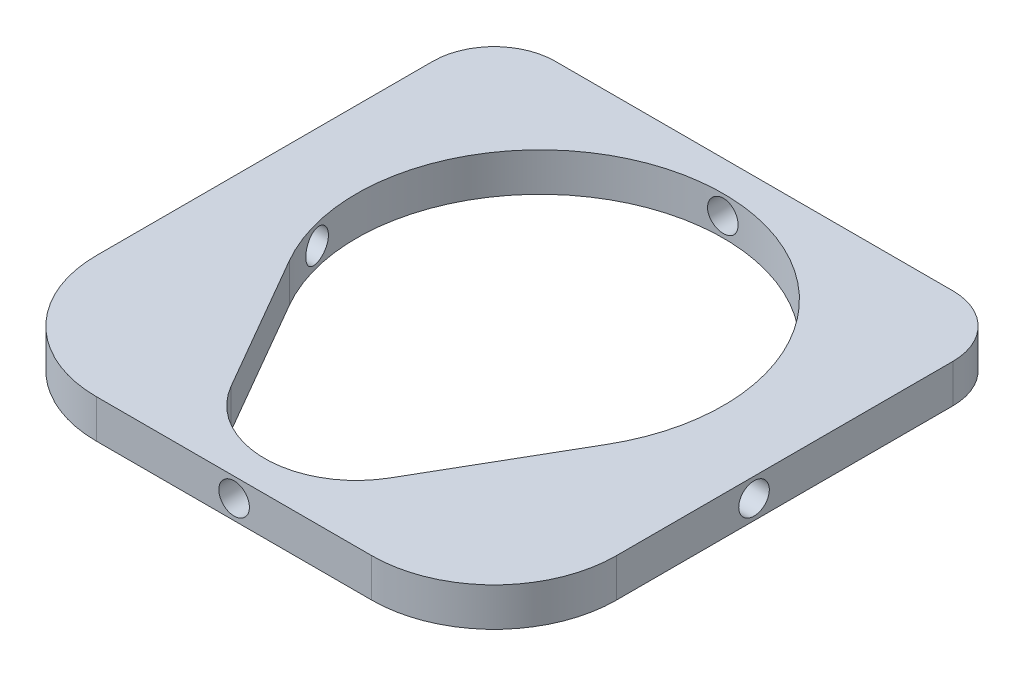
ISO-10303-21;
HEADER;
FILE_DESCRIPTION(('STEP AP214'),'2;1');
FILE_NAME('part.step','',(''),(''),'','','');
FILE_SCHEMA(('AUTOMOTIVE_DESIGN { 1 0 10303 214 1 1 1 1 }'));
ENDSEC;
DATA;
#1=APPLICATION_CONTEXT('core data for automotive mechanical design processes');
#2=APPLICATION_PROTOCOL_DEFINITION('international standard','automotive_design',2000,#1);
#3=PRODUCT_CONTEXT('',#1,'mechanical');
#4=PRODUCT('Part','Part','',(#3));
#5=PRODUCT_RELATED_PRODUCT_CATEGORY('part','',(#4));
#6=PRODUCT_DEFINITION_FORMATION('','',#4);
#7=PRODUCT_DEFINITION_CONTEXT('part definition',#1,'design');
#8=PRODUCT_DEFINITION('design','',#6,#7);
#9=PRODUCT_DEFINITION_SHAPE('','',#8);
#10=(LENGTH_UNIT() NAMED_UNIT(*) SI_UNIT(.MILLI.,.METRE.));
#11=(NAMED_UNIT(*) PLANE_ANGLE_UNIT() SI_UNIT($,.RADIAN.));
#12=(NAMED_UNIT(*) SI_UNIT($,.STERADIAN.) SOLID_ANGLE_UNIT());
#13=UNCERTAINTY_MEASURE_WITH_UNIT(LENGTH_MEASURE(1.E-05),#10,'distance_accuracy_value','');
#14=(GEOMETRIC_REPRESENTATION_CONTEXT(3) GLOBAL_UNCERTAINTY_ASSIGNED_CONTEXT((#13)) GLOBAL_UNIT_ASSIGNED_CONTEXT((#10,
#11,#12)) REPRESENTATION_CONTEXT('',''));
#15=CARTESIAN_POINT('',(0.,0.,0.));
#16=DIRECTION('',(0.,0.,1.));
#17=DIRECTION('',(1.,0.,0.));
#18=AXIS2_PLACEMENT_3D('',#15,#16,#17);
#19=CARTESIAN_POINT('',(0.,6.3,0.));
#20=DIRECTION('',(1.,0.,0.));
#21=DIRECTION('',(0.,0.,-1.));
#22=AXIS2_PLACEMENT_3D('',#19,#20,#21);
#23=PLANE('',#22);
#24=CARTESIAN_POINT('',(0.,3.15,-42.5));
#25=DIRECTION('',(-1.,0.,0.));
#26=DIRECTION('',(0.,0.,1.));
#27=AXIS2_PLACEMENT_3D('',#24,#25,#26);
#28=CIRCLE('',#27,2.5);
#29=CARTESIAN_POINT('',(0.,3.15,-40.));
#30=VERTEX_POINT('',#29);
#31=EDGE_CURVE('E446',#30,#30,#28,.T.);
#32=ORIENTED_EDGE('',*,*,#31,.F.);
#33=EDGE_LOOP('',(#32));
#34=FACE_BOUND('',#33,.T.);
#35=DIRECTION('',(0.,0.,1.));
#36=VECTOR('',#35,1.);
#37=CARTESIAN_POINT('',(0.,6.3,0.));
#38=LINE('',#37,#36);
#39=CARTESIAN_POINT('',(0.,6.3,-75.));
#40=VERTEX_POINT('',#39);
#41=CARTESIAN_POINT('',(0.,6.3,-20.));
#42=VERTEX_POINT('',#41);
#43=EDGE_CURVE('E160',#40,#42,#38,.T.);
#44=ORIENTED_EDGE('',*,*,#43,.F.);
#45=DIRECTION('',(0.,-1.,0.));
#46=VECTOR('',#45,1.);
#47=CARTESIAN_POINT('',(0.,6.3,-75.));
#48=LINE('',#47,#46);
#49=CARTESIAN_POINT('',(0.,0.,-75.));
#50=VERTEX_POINT('',#49);
#51=EDGE_CURVE('E11',#40,#50,#48,.T.);
#52=ORIENTED_EDGE('',*,*,#51,.T.);
#53=DIRECTION('',(0.,0.,1.));
#54=VECTOR('',#53,1.);
#55=CARTESIAN_POINT('',(0.,0.,0.));
#56=LINE('',#55,#54);
#57=CARTESIAN_POINT('',(0.,0.,-20.));
#58=VERTEX_POINT('',#57);
#59=EDGE_CURVE('E157',#50,#58,#56,.T.);
#60=ORIENTED_EDGE('',*,*,#59,.T.);
#61=DIRECTION('',(0.,-1.,0.));
#62=VECTOR('',#61,1.);
#63=CARTESIAN_POINT('',(0.,6.3,-20.));
#64=LINE('',#63,#62);
#65=EDGE_CURVE('E251',#58,#42,#64,.F.);
#66=ORIENTED_EDGE('',*,*,#65,.T.);
#67=EDGE_LOOP('',(#44,#52,#60,#66));
#68=FACE_BOUND('',#67,.T.);
#69=ADVANCED_FACE('F33',(#34,#68),#23,.F.);
#70=CARTESIAN_POINT('',(0.,6.3,0.));
#71=DIRECTION('',(0.,0.,-1.));
#72=DIRECTION('',(-1.,0.,0.));
#73=AXIS2_PLACEMENT_3D('',#70,#71,#72);
#74=PLANE('',#73);
#75=CARTESIAN_POINT('',(42.5,3.15,0.));
#76=DIRECTION('',(0.,0.,1.));
#77=DIRECTION('',(1.,0.,0.));
#78=AXIS2_PLACEMENT_3D('',#75,#76,#77);
#79=CIRCLE('',#78,2.5);
#80=CARTESIAN_POINT('',(45.,3.15,0.));
#81=VERTEX_POINT('',#80);
#82=EDGE_CURVE('E219',#81,#81,#79,.T.);
#83=ORIENTED_EDGE('',*,*,#82,.F.);
#84=EDGE_LOOP('',(#83));
#85=FACE_BOUND('',#84,.T.);
#86=DIRECTION('',(1.,0.,0.));
#87=VECTOR('',#86,1.);
#88=CARTESIAN_POINT('',(0.,0.,0.));
#89=LINE('',#88,#87);
#90=CARTESIAN_POINT('',(20.,0.,0.));
#91=VERTEX_POINT('',#90);
#92=CARTESIAN_POINT('',(65.,0.,0.));
#93=VERTEX_POINT('',#92);
#94=EDGE_CURVE('E172',#91,#93,#89,.T.);
#95=ORIENTED_EDGE('',*,*,#94,.T.);
#96=DIRECTION('',(0.,-1.,0.));
#97=VECTOR('',#96,1.);
#98=CARTESIAN_POINT('',(65.,6.3,0.));
#99=LINE('',#98,#97);
#100=CARTESIAN_POINT('',(65.,6.3,0.));
#101=VERTEX_POINT('',#100);
#102=EDGE_CURVE('E245',#93,#101,#99,.F.);
#103=ORIENTED_EDGE('',*,*,#102,.T.);
#104=DIRECTION('',(1.,0.,0.));
#105=VECTOR('',#104,1.);
#106=CARTESIAN_POINT('',(0.,6.3,0.));
#107=LINE('',#106,#105);
#108=CARTESIAN_POINT('',(20.,6.3,0.));
#109=VERTEX_POINT('',#108);
#110=EDGE_CURVE('E162',#109,#101,#107,.T.);
#111=ORIENTED_EDGE('',*,*,#110,.F.);
#112=DIRECTION('',(0.,-1.,0.));
#113=VECTOR('',#112,1.);
#114=CARTESIAN_POINT('',(20.,6.3,0.));
#115=LINE('',#114,#113);
#116=EDGE_CURVE('E242',#109,#91,#115,.T.);
#117=ORIENTED_EDGE('',*,*,#116,.T.);
#118=EDGE_LOOP('',(#95,#103,#111,#117));
#119=FACE_BOUND('',#118,.T.);
#120=ADVANCED_FACE('F283',(#85,#119),#74,.F.);
#121=CARTESIAN_POINT('',(85.,6.3,0.));
#122=DIRECTION('',(-1.,0.,0.));
#123=DIRECTION('',(0.,0.,1.));
#124=AXIS2_PLACEMENT_3D('',#121,#122,#123);
#125=PLANE('',#124);
#126=CARTESIAN_POINT('',(85.,3.15,-42.5));
#127=DIRECTION('',(-1.,0.,0.));
#128=DIRECTION('',(0.,0.,1.));
#129=AXIS2_PLACEMENT_3D('',#126,#127,#128);
#130=CIRCLE('',#129,2.5);
#131=CARTESIAN_POINT('',(85.,3.15,-40.));
#132=VERTEX_POINT('',#131);
#133=EDGE_CURVE('E449',#132,#132,#130,.T.);
#134=ORIENTED_EDGE('',*,*,#133,.T.);
#135=EDGE_LOOP('',(#134));
#136=FACE_BOUND('',#135,.T.);
#137=DIRECTION('',(0.,0.,-1.));
#138=VECTOR('',#137,1.);
#139=CARTESIAN_POINT('',(85.,0.,0.));
#140=LINE('',#139,#138);
#141=CARTESIAN_POINT('',(85.,0.,-20.));
#142=VERTEX_POINT('',#141);
#143=CARTESIAN_POINT('',(85.,0.,-75.));
#144=VERTEX_POINT('',#143);
#145=EDGE_CURVE('E175',#142,#144,#140,.T.);
#146=ORIENTED_EDGE('',*,*,#145,.T.);
#147=DIRECTION('',(0.,-1.,0.));
#148=VECTOR('',#147,1.);
#149=CARTESIAN_POINT('',(85.,6.3,-75.));
#150=LINE('',#149,#148);
#151=CARTESIAN_POINT('',(85.,6.3,-75.));
#152=VERTEX_POINT('',#151);
#153=EDGE_CURVE('E56',#144,#152,#150,.F.);
#154=ORIENTED_EDGE('',*,*,#153,.T.);
#155=DIRECTION('',(0.,0.,-1.));
#156=VECTOR('',#155,1.);
#157=CARTESIAN_POINT('',(85.,6.3,0.));
#158=LINE('',#157,#156);
#159=CARTESIAN_POINT('',(85.,6.3,-20.));
#160=VERTEX_POINT('',#159);
#161=EDGE_CURVE('E166',#160,#152,#158,.T.);
#162=ORIENTED_EDGE('',*,*,#161,.F.);
#163=DIRECTION('',(0.,-1.,0.));
#164=VECTOR('',#163,1.);
#165=CARTESIAN_POINT('',(85.,6.3,-20.));
#166=LINE('',#165,#164);
#167=EDGE_CURVE('E185',#160,#142,#166,.T.);
#168=ORIENTED_EDGE('',*,*,#167,.T.);
#169=EDGE_LOOP('',(#146,#154,#162,#168));
#170=FACE_BOUND('',#169,.T.);
#171=ADVANCED_FACE('F275',(#136,#170),#125,.F.);
#172=CARTESIAN_POINT('',(0.,6.3,-85.));
#173=DIRECTION('',(0.,0.,1.));
#174=DIRECTION('',(1.,0.,0.));
#175=AXIS2_PLACEMENT_3D('',#172,#173,#174);
#176=PLANE('',#175);
#177=CARTESIAN_POINT('',(42.5,3.15,-85.));
#178=DIRECTION('',(0.,0.,1.));
#179=DIRECTION('',(1.,0.,0.));
#180=AXIS2_PLACEMENT_3D('',#177,#178,#179);
#181=CIRCLE('',#180,2.5);
#182=CARTESIAN_POINT('',(45.,3.15,-85.));
#183=VERTEX_POINT('',#182);
#184=EDGE_CURVE('E194',#183,#183,#181,.T.);
#185=ORIENTED_EDGE('',*,*,#184,.T.);
#186=EDGE_LOOP('',(#185));
#187=FACE_BOUND('',#186,.T.);
#188=DIRECTION('',(-1.,0.,0.));
#189=VECTOR('',#188,1.);
#190=CARTESIAN_POINT('',(0.,6.3,-85.));
#191=LINE('',#190,#189);
#192=CARTESIAN_POINT('',(75.,6.3,-85.));
#193=VERTEX_POINT('',#192);
#194=CARTESIAN_POINT('',(10.,6.3,-85.));
#195=VERTEX_POINT('',#194);
#196=EDGE_CURVE('E168',#193,#195,#191,.T.);
#197=ORIENTED_EDGE('',*,*,#196,.F.);
#198=DIRECTION('',(0.,-1.,0.));
#199=VECTOR('',#198,1.);
#200=CARTESIAN_POINT('',(75.,6.3,-85.));
#201=LINE('',#200,#199);
#202=CARTESIAN_POINT('',(75.,0.,-85.));
#203=VERTEX_POINT('',#202);
#204=EDGE_CURVE('E256',#193,#203,#201,.T.);
#205=ORIENTED_EDGE('',*,*,#204,.T.);
#206=DIRECTION('',(-1.,0.,0.));
#207=VECTOR('',#206,1.);
#208=CARTESIAN_POINT('',(0.,0.,-85.));
#209=LINE('',#208,#207);
#210=CARTESIAN_POINT('',(10.,0.,-85.));
#211=VERTEX_POINT('',#210);
#212=EDGE_CURVE('E163',#203,#211,#209,.T.);
#213=ORIENTED_EDGE('',*,*,#212,.T.);
#214=DIRECTION('',(0.,-1.,0.));
#215=VECTOR('',#214,1.);
#216=CARTESIAN_POINT('',(10.,6.3,-85.));
#217=LINE('',#216,#215);
#218=EDGE_CURVE('E254',#211,#195,#217,.F.);
#219=ORIENTED_EDGE('',*,*,#218,.T.);
#220=EDGE_LOOP('',(#197,#205,#213,#219));
#221=FACE_BOUND('',#220,.T.);
#222=ADVANCED_FACE('F269',(#187,#221),#176,.F.);
#223=CARTESIAN_POINT('',(0.,6.3,0.));
#224=DIRECTION('',(0.,-1.,0.));
#225=DIRECTION('',(0.,0.,-1.));
#226=AXIS2_PLACEMENT_3D('',#223,#224,#225);
#227=PLANE('',#226);
#228=DIRECTION('',(0.5,0.,0.866025403784438));
#229=VECTOR('',#228,1.);
#230=CARTESIAN_POINT('',(16.5192378864669,6.3,-35.));
#231=LINE('',#230,#229);
#232=CARTESIAN_POINT('',(16.5192378864669,6.3,-35.));
#233=VERTEX_POINT('',#232);
#234=CARTESIAN_POINT('',(29.5096189432334,6.3,-12.5));
#235=VERTEX_POINT('',#234);
#236=EDGE_CURVE('E141',#233,#235,#231,.T.);
#237=ORIENTED_EDGE('',*,*,#236,.F.);
#238=CARTESIAN_POINT('',(42.5,6.3,-50.));
#239=DIRECTION('',(0.,1.,0.));
#240=DIRECTION('',(0.,0.,1.));
#241=AXIS2_PLACEMENT_3D('',#238,#239,#240);
#242=CIRCLE('',#241,30.);
#243=CARTESIAN_POINT('',(68.4807621135332,6.3,-35.));
#244=VERTEX_POINT('',#243);
#245=EDGE_CURVE('E146',#244,#233,#242,.T.);
#246=ORIENTED_EDGE('',*,*,#245,.F.);
#247=DIRECTION('',(0.5,0.,-0.866025403784439));
#248=VECTOR('',#247,1.);
#249=CARTESIAN_POINT('',(55.4903810567666,6.3,-12.5));
#250=LINE('',#249,#248);
#251=CARTESIAN_POINT('',(55.4903810567666,6.3,-12.5));
#252=VERTEX_POINT('',#251);
#253=EDGE_CURVE('E150',#252,#244,#250,.T.);
#254=ORIENTED_EDGE('',*,*,#253,.F.);
#255=CARTESIAN_POINT('',(42.5,6.3,-20.));
#256=DIRECTION('',(0.,1.,0.));
#257=DIRECTION('',(0.,0.,1.));
#258=AXIS2_PLACEMENT_3D('',#255,#256,#257);
#259=CIRCLE('',#258,15.);
#260=EDGE_CURVE('E130',#235,#252,#259,.T.);
#261=ORIENTED_EDGE('',*,*,#260,.F.);
#262=EDGE_LOOP('',(#237,#246,#254,#261));
#263=FACE_BOUND('',#262,.T.);
#264=ORIENTED_EDGE('',*,*,#161,.T.);
#265=CARTESIAN_POINT('',(75.,6.3,-75.));
#266=DIRECTION('',(0.,-1.,0.));
#267=DIRECTION('',(0.,0.,-1.));
#268=AXIS2_PLACEMENT_3D('',#265,#266,#267);
#269=CIRCLE('',#268,10.);
#270=EDGE_CURVE('E41',#152,#193,#269,.F.);
#271=ORIENTED_EDGE('',*,*,#270,.T.);
#272=ORIENTED_EDGE('',*,*,#196,.T.);
#273=CARTESIAN_POINT('',(10.,6.3,-75.));
#274=DIRECTION('',(0.,-1.,0.));
#275=DIRECTION('',(0.,0.,-1.));
#276=AXIS2_PLACEMENT_3D('',#273,#274,#275);
#277=CIRCLE('',#276,10.);
#278=EDGE_CURVE('E48',#195,#40,#277,.F.);
#279=ORIENTED_EDGE('',*,*,#278,.T.);
#280=ORIENTED_EDGE('',*,*,#43,.T.);
#281=CARTESIAN_POINT('',(20.,6.3,-20.));
#282=DIRECTION('',(0.,-1.,0.));
#283=DIRECTION('',(0.,0.,-1.));
#284=AXIS2_PLACEMENT_3D('',#281,#282,#283);
#285=CIRCLE('',#284,20.);
#286=EDGE_CURVE('E247',#42,#109,#285,.F.);
#287=ORIENTED_EDGE('',*,*,#286,.T.);
#288=ORIENTED_EDGE('',*,*,#110,.T.);
#289=CARTESIAN_POINT('',(65.,6.3,-20.));
#290=DIRECTION('',(0.,-1.,0.));
#291=DIRECTION('',(0.,0.,-1.));
#292=AXIS2_PLACEMENT_3D('',#289,#290,#291);
#293=CIRCLE('',#292,20.);
#294=EDGE_CURVE('E249',#101,#160,#293,.F.);
#295=ORIENTED_EDGE('',*,*,#294,.T.);
#296=EDGE_LOOP('',(#264,#271,#272,#279,#280,#287,#288,#295));
#297=FACE_BOUND('',#296,.T.);
#298=ADVANCED_FACE('F148',(#263,#297),#227,.F.);
#299=CARTESIAN_POINT('',(0.,0.,0.));
#300=DIRECTION('',(0.,-1.,0.));
#301=DIRECTION('',(0.,0.,-1.));
#302=AXIS2_PLACEMENT_3D('',#299,#300,#301);
#303=PLANE('',#302);
#304=CARTESIAN_POINT('',(42.5,0.,-50.));
#305=DIRECTION('',(0.,-1.,0.));
#306=DIRECTION('',(0.,0.,-1.));
#307=AXIS2_PLACEMENT_3D('',#304,#305,#306);
#308=CIRCLE('',#307,30.);
#309=CARTESIAN_POINT('',(16.5192378864669,0.,-35.));
#310=VERTEX_POINT('',#309);
#311=CARTESIAN_POINT('',(68.4807621135332,0.,-35.));
#312=VERTEX_POINT('',#311);
#313=EDGE_CURVE('E183',#310,#312,#308,.T.);
#314=ORIENTED_EDGE('',*,*,#313,.F.);
#315=DIRECTION('',(-0.5,0.,-0.866025403784438));
#316=VECTOR('',#315,1.);
#317=CARTESIAN_POINT('',(27.5448729810778,0.,-15.9030398304193));
#318=LINE('',#317,#316);
#319=CARTESIAN_POINT('',(29.5096189432334,0.,-12.5));
#320=VERTEX_POINT('',#319);
#321=EDGE_CURVE('E170',#320,#310,#318,.T.);
#322=ORIENTED_EDGE('',*,*,#321,.F.);
#323=CARTESIAN_POINT('',(42.5,0.,-20.));
#324=DIRECTION('',(0.,-1.,0.));
#325=DIRECTION('',(0.,0.,-1.));
#326=AXIS2_PLACEMENT_3D('',#323,#324,#325);
#327=CIRCLE('',#326,15.);
#328=CARTESIAN_POINT('',(55.4903810567666,0.,-12.5));
#329=VERTEX_POINT('',#328);
#330=EDGE_CURVE('E133',#329,#320,#327,.T.);
#331=ORIENTED_EDGE('',*,*,#330,.F.);
#332=DIRECTION('',(-0.5,0.,0.866025403784439));
#333=VECTOR('',#332,1.);
#334=CARTESIAN_POINT('',(36.2051270189222,0.,20.9030398304193));
#335=LINE('',#334,#333);
#336=EDGE_CURVE('E181',#312,#329,#335,.T.);
#337=ORIENTED_EDGE('',*,*,#336,.F.);
#338=EDGE_LOOP('',(#314,#322,#331,#337));
#339=FACE_BOUND('',#338,.T.);
#340=ORIENTED_EDGE('',*,*,#212,.F.);
#341=CARTESIAN_POINT('',(75.,0.,-75.));
#342=DIRECTION('',(0.,-1.,0.));
#343=DIRECTION('',(0.,0.,-1.));
#344=AXIS2_PLACEMENT_3D('',#341,#342,#343);
#345=CIRCLE('',#344,10.);
#346=EDGE_CURVE('E261',#203,#144,#345,.T.);
#347=ORIENTED_EDGE('',*,*,#346,.T.);
#348=ORIENTED_EDGE('',*,*,#145,.F.);
#349=CARTESIAN_POINT('',(65.,0.,-20.));
#350=DIRECTION('',(0.,-1.,0.));
#351=DIRECTION('',(0.,0.,-1.));
#352=AXIS2_PLACEMENT_3D('',#349,#350,#351);
#353=CIRCLE('',#352,20.);
#354=EDGE_CURVE('E240',#142,#93,#353,.T.);
#355=ORIENTED_EDGE('',*,*,#354,.T.);
#356=ORIENTED_EDGE('',*,*,#94,.F.);
#357=CARTESIAN_POINT('',(20.,0.,-20.));
#358=DIRECTION('',(0.,-1.,0.));
#359=DIRECTION('',(0.,0.,-1.));
#360=AXIS2_PLACEMENT_3D('',#357,#358,#359);
#361=CIRCLE('',#360,20.);
#362=EDGE_CURVE('E237',#91,#58,#361,.T.);
#363=ORIENTED_EDGE('',*,*,#362,.T.);
#364=ORIENTED_EDGE('',*,*,#59,.F.);
#365=CARTESIAN_POINT('',(10.,0.,-75.));
#366=DIRECTION('',(0.,-1.,0.));
#367=DIRECTION('',(0.,0.,-1.));
#368=AXIS2_PLACEMENT_3D('',#365,#366,#367);
#369=CIRCLE('',#368,10.);
#370=EDGE_CURVE('E259',#50,#211,#369,.T.);
#371=ORIENTED_EDGE('',*,*,#370,.T.);
#372=EDGE_LOOP('',(#340,#347,#348,#355,#356,#363,#364,#371));
#373=FACE_BOUND('',#372,.T.);
#374=ADVANCED_FACE('F225',(#339,#373),#303,.T.);
#375=CARTESIAN_POINT('',(42.5,-3.7,-50.));
#376=DIRECTION('',(0.,1.,0.));
#377=DIRECTION('',(0.,0.,1.));
#378=AXIS2_PLACEMENT_3D('',#375,#376,#377);
#379=CYLINDRICAL_SURFACE('',#378,30.);
#380=CARTESIAN_POINT('',(70.7842712474619,3.15,-40.));
#381=CARTESIAN_POINT('',(70.7842745461034,3.01507488080024,-40.0000068252859));
#382=CARTESIAN_POINT('',(70.7881572028325,2.88005304176365,-40.010970187135));
#383=CARTESIAN_POINT('',(70.8034667907939,2.61386486928332,-40.05443441423));
#384=CARTESIAN_POINT('',(70.8149026451648,2.4827032879119,-40.0869607535495));
#385=CARTESIAN_POINT('',(70.8446229802756,2.22825219517015,-40.172265301055));
#386=CARTESIAN_POINT('',(70.8628946791898,2.10494849142593,-40.2250057169516));
#387=CARTESIAN_POINT('',(70.9052974274408,1.86913969193915,-40.3489199253905));
#388=CARTESIAN_POINT('',(70.929427933106,1.7566335955769,-40.4200920075959));
#389=CARTESIAN_POINT('',(70.9831175332209,1.54203729667637,-40.5809034699253));
#390=CARTESIAN_POINT('',(71.0128094223934,1.44032576650629,-40.6710031145989));
#391=CARTESIAN_POINT('',(71.0757982686736,1.25328599559157,-40.8657666182573));
#392=CARTESIAN_POINT('',(71.1090961402248,1.16796192584034,-40.9704341734568));
#393=CARTESIAN_POINT('',(71.1797327108047,1.01157072987858,-41.1972883046544));
#394=CARTESIAN_POINT('',(71.2171911382768,0.941461891342386,-41.3200988478498));
#395=CARTESIAN_POINT('',(71.2931496512233,0.822959239517544,-41.575495220489));
#396=CARTESIAN_POINT('',(71.331649945415,0.774569811939291,-41.7080830179258));
#397=CARTESIAN_POINT('',(71.4095612799225,0.699560286502884,-41.9838654632819));
#398=CARTESIAN_POINT('',(71.4489629491476,0.673671599967631,-42.1272624533035));
#399=CARTESIAN_POINT('',(71.5261551959953,0.647158723226745,-42.4168106557994));
#400=CARTESIAN_POINT('',(71.5639457469174,0.646534951567005,-42.5629619138615));
#401=CARTESIAN_POINT('',(71.6367632085997,0.670845315417484,-42.8535722037818));
#402=CARTESIAN_POINT('',(71.6717947408371,0.695735689012401,-42.9980337047715));
#403=CARTESIAN_POINT('',(71.7382993289798,0.770663231515943,-43.2811459569061));
#404=CARTESIAN_POINT('',(71.7697728328125,0.820697230715486,-43.4197974380998));
#405=CARTESIAN_POINT('',(71.8278314205558,0.943283018164972,-43.6836609625199));
#406=CARTESIAN_POINT('',(71.8545158317984,1.01526457090408,-43.8091159580114));
#407=CARTESIAN_POINT('',(71.9035377415539,1.18026821196048,-44.0462909948082));
#408=CARTESIAN_POINT('',(71.925875891202,1.27328714404061,-44.1580130925825));
#409=CARTESIAN_POINT('',(71.9654988482725,1.47503812789215,-44.361308036007));
#410=CARTESIAN_POINT('',(71.9829020653827,1.58328748222718,-44.4533370531362));
#411=CARTESIAN_POINT('',(72.0133987448326,1.8142103325119,-44.6179626245817));
#412=CARTESIAN_POINT('',(72.0264926472972,1.93688235368796,-44.6905611632568));
#413=CARTESIAN_POINT('',(72.0482264107505,2.19080384738397,-44.8128885104504));
#414=CARTESIAN_POINT('',(72.0569410976265,2.3218627706266,-44.8629998344669));
#415=CARTESIAN_POINT('',(72.0703316482215,2.59070182826048,-44.9406470101779));
#416=CARTESIAN_POINT('',(72.0750077254907,2.72848160686483,-44.9681840555324));
#417=CARTESIAN_POINT('',(72.0803505911879,3.00561711707688,-44.999688434276));
#418=CARTESIAN_POINT('',(72.0810504965554,3.14495011723183,-45.0038504514417));
#419=CARTESIAN_POINT('',(72.0785384195417,3.42233808688244,-44.9890001387518));
#420=CARTESIAN_POINT('',(72.0753265238892,3.56039308464434,-44.9699883226837));
#421=CARTESIAN_POINT('',(72.0649640559923,3.83103158412566,-44.9094370802788));
#422=CARTESIAN_POINT('',(72.0578211532271,3.96362520139628,-44.8679415226318));
#423=CARTESIAN_POINT('',(72.03953686741,4.21989187947147,-44.7637280905939));
#424=CARTESIAN_POINT('',(72.0283954933311,4.3435649602938,-44.7010102638278));
#425=CARTESIAN_POINT('',(72.0020117746199,4.57894195698922,-44.5560377352079));
#426=CARTESIAN_POINT('',(71.9867562846353,4.6906058732126,-44.4737205101914));
#427=CARTESIAN_POINT('',(71.9521518116548,4.89847210381651,-44.2921746106501));
#428=CARTESIAN_POINT('',(71.9328027088349,4.99467396546233,-44.1929454411126));
#429=CARTESIAN_POINT('',(71.8898847272955,5.16999914028478,-43.979483232101));
#430=CARTESIAN_POINT('',(71.8662753316766,5.24894078738926,-43.8651092140288));
#431=CARTESIAN_POINT('',(71.8152077892079,5.38656415546631,-43.6255527243873));
#432=CARTESIAN_POINT('',(71.7877493293889,5.44524422761589,-43.5003693742243));
#433=CARTESIAN_POINT('',(71.728826213819,5.54198827943262,-43.24027949121));
#434=CARTESIAN_POINT('',(71.697294246441,5.57963080035531,-43.1052315656265));
#435=CARTESIAN_POINT('',(71.6312845173166,5.63184819445665,-42.831450923843));
#436=CARTESIAN_POINT('',(71.5968063343906,5.6464197636674,-42.6927176827647));
#437=CARTESIAN_POINT('',(71.5247746066406,5.65249361232225,-42.4115835061041));
#438=CARTESIAN_POINT('',(71.4871634637992,5.64336829586957,-42.2691837423156));
#439=CARTESIAN_POINT('',(71.410787166526,5.60118894181782,-41.9882842880793));
#440=CARTESIAN_POINT('',(71.372021830246,5.56813111421207,-41.8497852189638));
#441=CARTESIAN_POINT('',(71.2937329411524,5.4780275378508,-41.5773231612774));
#442=CARTESIAN_POINT('',(71.2542118648634,5.42046082419265,-41.4435313804317));
#443=CARTESIAN_POINT('',(71.1768035010083,5.28275866412667,-41.1875747558116));
#444=CARTESIAN_POINT('',(71.1389162742815,5.20262237813632,-41.0654103447988));
#445=CARTESIAN_POINT('',(71.0664854195684,5.02187002563787,-40.8364677355847));
#446=CARTESIAN_POINT('',(71.0319366308278,4.92128634008234,-40.7296656603204));
#447=CARTESIAN_POINT('',(70.9678322638095,4.70205040905946,-40.5346372360007));
#448=CARTESIAN_POINT('',(70.938276927601,4.5833972881639,-40.4464117874396));
#449=CARTESIAN_POINT('',(70.8867928223023,4.33584330121351,-40.2945265860438));
#450=CARTESIAN_POINT('',(70.8646286224412,4.20746232447987,-40.230099530682));
#451=CARTESIAN_POINT('',(70.8278712655554,3.94073502192031,-40.1240241510762));
#452=CARTESIAN_POINT('',(70.8132655444533,3.80240567166017,-40.0823380194546));
#453=CARTESIAN_POINT('',(70.7967381590342,3.57744224750926,-40.0353160391142));
#454=CARTESIAN_POINT('',(70.7920749535201,3.4925753810137,-40.0220952828788));
#455=CARTESIAN_POINT('',(70.785840498107,3.32181873028352,-40.0044352341134));
#456=CARTESIAN_POINT('',(70.7842691466752,3.23592897973242,-39.9999956532196));
#457=CARTESIAN_POINT('',(70.7842712474619,3.15,-40.));
#458=B_SPLINE_CURVE_WITH_KNOTS('',3,(#380,#381,#382,#383,#384,#385,#386,#387,#388,#389,#390,
#391,#392,#393,#394,#395,#396,#397,#398,#399,#400,#401,#402,#403,#404,#405,#406,#407,#408,#409,
#410,#411,#412,#413,#414,#415,#416,#417,#418,#419,#420,#421,#422,#423,#424,#425,#426,#427,#428,
#429,#430,#431,#432,#433,#434,#435,#436,#437,#438,#439,#440,#441,#442,#443,#444,#445,#446,#447,
#448,#449,#450,#451,#452,#453,#454,#455,#456,#457),.UNSPECIFIED.,.T.,.F.,(4,2,2,2,2,2,2,2,2,2,2,
2,2,2,2,2,2,2,2,2,2,2,2,2,2,2,2,2,2,2,2,2,2,2,2,2,2,2,4),(0.,0.40445064778418,0.809379959044663,
1.21355587748118,1.6176943044925,2.03312012772737,2.44865154686985,2.88554232746866,
3.32252128796277,3.77322393005451,4.2239340386136,4.67387237968031,5.1237540138888,
5.56282063561128,6.0018214278334,6.42916792174696,6.85647075576696,7.2762005266126,
7.69590810197519,8.11211481246918,8.52831229540397,8.94370063210939,9.35908803665075,
9.77581873586368,10.1925616348842,10.6134995952941,11.0344718022377,11.463600235411,
11.8927901180809,12.3334620093503,12.7742037016881,13.224822366363,13.6754577961556,
14.1253850725434,14.5753341539518,15.0091522729875,15.4422469428911,15.6998355450819,
15.9574156882186),.UNSPECIFIED.);
#459=CARTESIAN_POINT('',(70.7842712474619,3.15,-40.));
#460=VERTEX_POINT('',#459);
#461=EDGE_CURVE('E230',#460,#460,#458,.T.);
#462=ORIENTED_EDGE('',*,*,#461,.T.);
#463=EDGE_LOOP('',(#462));
#464=FACE_BOUND('',#463,.T.);
#465=CARTESIAN_POINT('',(14.2157287525381,3.15,-40.));
#466=CARTESIAN_POINT('',(14.2157254538966,3.28492511919976,-40.0000068252859));
#467=CARTESIAN_POINT('',(14.2118427971675,3.41994695823636,-40.010970187135));
#468=CARTESIAN_POINT('',(14.1965332092061,3.68613513071668,-40.05443441423));
#469=CARTESIAN_POINT('',(14.1850973548353,3.8172967120881,-40.0869607535495));
#470=CARTESIAN_POINT('',(14.1553770197244,4.07174780482985,-40.172265301055));
#471=CARTESIAN_POINT('',(14.1371053208102,4.19505150857408,-40.2250057169516));
#472=CARTESIAN_POINT('',(14.0947025725593,4.43086030806085,-40.3489199253905));
#473=CARTESIAN_POINT('',(14.0705720668941,4.54336640442311,-40.4200920075959));
#474=CARTESIAN_POINT('',(14.0168824667791,4.75796270332363,-40.5809034699253));
#475=CARTESIAN_POINT('',(13.9871905776066,4.85967423349372,-40.6710031145989));
#476=CARTESIAN_POINT('',(13.9242017313264,5.04671400440843,-40.8657666182573));
#477=CARTESIAN_POINT('',(13.8909038597752,5.13203807415966,-40.9704341734568));
#478=CARTESIAN_POINT('',(13.8202672891953,5.28842927012142,-41.1972883046544));
#479=CARTESIAN_POINT('',(13.7828088617232,5.35853810865762,-41.3200988478498));
#480=CARTESIAN_POINT('',(13.7068503487767,5.47704076048246,-41.575495220489));
#481=CARTESIAN_POINT('',(13.6683500545851,5.52543018806072,-41.7080830179258));
#482=CARTESIAN_POINT('',(13.5904387200775,5.60043971349712,-41.9838654632819));
#483=CARTESIAN_POINT('',(13.5510370508524,5.62632840003237,-42.1272624533035));
#484=CARTESIAN_POINT('',(13.4738448040047,5.65284127677326,-42.4168106557994));
#485=CARTESIAN_POINT('',(13.4360542530827,5.653465048433,-42.5629619138615));
#486=CARTESIAN_POINT('',(13.3632367914003,5.62915468458252,-42.8535722037818));
#487=CARTESIAN_POINT('',(13.328205259163,5.6042643109876,-42.9980337047715));
#488=CARTESIAN_POINT('',(13.2617006710202,5.52933676848406,-43.2811459569061));
#489=CARTESIAN_POINT('',(13.2302271671875,5.47930276928452,-43.4197974380998));
#490=CARTESIAN_POINT('',(13.1721685794442,5.35671698183503,-43.6836609625199));
#491=CARTESIAN_POINT('',(13.1454841682016,5.28473542909592,-43.8091159580114));
#492=CARTESIAN_POINT('',(13.0964622584461,5.11973178803952,-44.0462909948082));
#493=CARTESIAN_POINT('',(13.074124108798,5.0267128559594,-44.1580130925825));
#494=CARTESIAN_POINT('',(13.0345011517275,4.82496187210786,-44.361308036007));
#495=CARTESIAN_POINT('',(13.0170979346174,4.71671251777282,-44.4533370531361));
#496=CARTESIAN_POINT('',(12.9866012551674,4.48578966748811,-44.6179626245817));
#497=CARTESIAN_POINT('',(12.9735073527028,4.36311764631205,-44.6905611632568));
#498=CARTESIAN_POINT('',(12.9517735892495,4.10919615261604,-44.8128885104504));
#499=CARTESIAN_POINT('',(12.9430589023735,3.97813722937341,-44.8629998344669));
#500=CARTESIAN_POINT('',(12.9296683517785,3.70929817173953,-44.9406470101779));
#501=CARTESIAN_POINT('',(12.9249922745093,3.57151839313517,-44.9681840555324));
#502=CARTESIAN_POINT('',(12.9196494088122,3.29438288292312,-44.999688434276));
#503=CARTESIAN_POINT('',(12.9189495034447,3.15504988276817,-45.0038504514417));
#504=CARTESIAN_POINT('',(12.9214615804583,2.87766191311756,-44.9890001387518));
#505=CARTESIAN_POINT('',(12.9246734761108,2.73960691535566,-44.9699883226837));
#506=CARTESIAN_POINT('',(12.9350359440077,2.46896841587435,-44.9094370802788));
#507=CARTESIAN_POINT('',(12.942178846773,2.33637479860373,-44.8679415226318));
#508=CARTESIAN_POINT('',(12.9604631325901,2.08010812052854,-44.7637280905939));
#509=CARTESIAN_POINT('',(12.971604506669,1.95643503970621,-44.7010102638278));
#510=CARTESIAN_POINT('',(12.9979882253801,1.72105804301078,-44.5560377352079));
#511=CARTESIAN_POINT('',(13.0132437153648,1.6093941267874,-44.4737205101914));
#512=CARTESIAN_POINT('',(13.0478481883452,1.40152789618349,-44.2921746106501));
#513=CARTESIAN_POINT('',(13.0671972911651,1.30532603453767,-44.1929454411126));
#514=CARTESIAN_POINT('',(13.1101152727045,1.13000085971522,-43.979483232101));
#515=CARTESIAN_POINT('',(13.1337246683234,1.05105921261075,-43.8651092140288));
#516=CARTESIAN_POINT('',(13.1847922107922,0.913435844533693,-43.6255527243873));
#517=CARTESIAN_POINT('',(13.2122506706112,0.854755772384115,-43.5003693742243));
#518=CARTESIAN_POINT('',(13.271173786181,0.758011720567385,-43.24027949121));
#519=CARTESIAN_POINT('',(13.302705753559,0.720369199644693,-43.1052315656265));
#520=CARTESIAN_POINT('',(13.3687154826834,0.668151805543352,-42.831450923843));
#521=CARTESIAN_POINT('',(13.4031936656094,0.653580236332607,-42.6927176827647));
#522=CARTESIAN_POINT('',(13.4752253933594,0.647506387677755,-42.4115835061041));
#523=CARTESIAN_POINT('',(13.5128365362008,0.656631704130433,-42.2691837423156));
#524=CARTESIAN_POINT('',(13.589212833474,0.698811058182185,-41.9882842880793));
#525=CARTESIAN_POINT('',(13.6279781697541,0.731868885787933,-41.8497852189638));
#526=CARTESIAN_POINT('',(13.7062670588476,0.821972462149207,-41.5773231612774));
#527=CARTESIAN_POINT('',(13.7457881351366,0.879539175807353,-41.4435313804317));
#528=CARTESIAN_POINT('',(13.8231964989917,1.01724133587333,-41.1875747558116));
#529=CARTESIAN_POINT('',(13.8610837257185,1.09737762186368,-41.0654103447988));
#530=CARTESIAN_POINT('',(13.9335145804316,1.27812997436213,-40.8364677355847));
#531=CARTESIAN_POINT('',(13.9680633691722,1.37871365991766,-40.7296656603204));
#532=CARTESIAN_POINT('',(14.0321677361905,1.59794959094055,-40.5346372360007));
#533=CARTESIAN_POINT('',(14.061723072399,1.71660271183611,-40.4464117874396));
#534=CARTESIAN_POINT('',(14.1132071776977,1.9641566987865,-40.2945265860438));
#535=CARTESIAN_POINT('',(14.1353713775588,2.09253767552013,-40.230099530682));
#536=CARTESIAN_POINT('',(14.1721287344446,2.35926497807969,-40.1240241510762));
#537=CARTESIAN_POINT('',(14.1867344555467,2.49759432833983,-40.0823380194546));
#538=CARTESIAN_POINT('',(14.2032618409658,2.72255775249075,-40.0353160391142));
#539=CARTESIAN_POINT('',(14.20792504648,2.80742461898631,-40.0220952828788));
#540=CARTESIAN_POINT('',(14.214159501893,2.97818126971649,-40.0044352341134));
#541=CARTESIAN_POINT('',(14.2157308533248,3.06407102026758,-39.9999956532196));
#542=CARTESIAN_POINT('',(14.2157287525381,3.15,-40.));
#543=B_SPLINE_CURVE_WITH_KNOTS('',3,(#465,#466,#467,#468,#469,#470,#471,#472,#473,#474,#475,
#476,#477,#478,#479,#480,#481,#482,#483,#484,#485,#486,#487,#488,#489,#490,#491,#492,#493,#494,
#495,#496,#497,#498,#499,#500,#501,#502,#503,#504,#505,#506,#507,#508,#509,#510,#511,#512,#513,
#514,#515,#516,#517,#518,#519,#520,#521,#522,#523,#524,#525,#526,#527,#528,#529,#530,#531,#532,
#533,#534,#535,#536,#537,#538,#539,#540,#541,#542),.UNSPECIFIED.,.T.,.F.,(4,2,2,2,2,2,2,2,2,2,2,
2,2,2,2,2,2,2,2,2,2,2,2,2,2,2,2,2,2,2,2,2,2,2,2,2,2,2,4),(0.,0.404450647784179,
0.809379959044662,1.21355587748118,1.61769430449249,2.03312012772737,2.44865154686985,
2.88554232746866,3.32252128796278,3.77322393005451,4.2239340386136,4.67387237968031,
5.1237540138888,5.56282063561128,6.0018214278334,6.42916792174696,6.85647075576695,
7.2762005266126,7.69590810197519,8.11211481246918,8.52831229540396,8.94370063210939,
9.35908803665075,9.77581873586369,10.1925616348842,10.6134995952941,11.0344718022377,
11.463600235411,11.8927901180809,12.3334620093503,12.7742037016881,13.224822366363,
13.6754577961556,14.1253850725434,14.5753341539518,15.0091522729875,15.4422469428911,
15.6998355450819,15.9574156882186),.UNSPECIFIED.);
#544=CARTESIAN_POINT('',(14.2157287525381,3.15,-40.));
#545=VERTEX_POINT('',#544);
#546=EDGE_CURVE('E195',#545,#545,#543,.T.);
#547=ORIENTED_EDGE('',*,*,#546,.T.);
#548=EDGE_LOOP('',(#547));
#549=FACE_BOUND('',#548,.T.);
#550=CARTESIAN_POINT('',(45.,3.15,-79.8956518577535));
#551=CARTESIAN_POINT('',(44.999993877076,3.00983572802399,-79.895653240209));
#552=CARTESIAN_POINT('',(44.9881727298996,2.8695760346058,-79.8966481995655));
#553=CARTESIAN_POINT('',(44.9411899476857,2.59293744914142,-79.9005204937317));
#554=CARTESIAN_POINT('',(44.9060018659041,2.45656313718097,-79.9033999613783));
#555=CARTESIAN_POINT('',(44.8133099618438,2.19174200968667,-79.9107128874002));
#556=CARTESIAN_POINT('',(44.7558187909388,2.06329074761261,-79.9151454646401));
#557=CARTESIAN_POINT('',(44.6201751712136,1.81789201197521,-79.9250640675404));
#558=CARTESIAN_POINT('',(44.5420271395317,1.7009420863624,-79.9305498679176));
#559=CARTESIAN_POINT('',(44.3670713411451,1.48153499233338,-79.9419726194871));
#560=CARTESIAN_POINT('',(44.2702215035047,1.37911142034258,-79.9479105692257));
#561=CARTESIAN_POINT('',(44.0607003016902,1.19195308440493,-79.9595594152693));
#562=CARTESIAN_POINT('',(43.9480282466342,1.10721909328103,-79.9652703016456));
#563=CARTESIAN_POINT('',(43.709860613272,0.95773346335954,-79.9758310126879));
#564=CARTESIAN_POINT('',(43.5843467303146,0.893010892046375,-79.9806795804987));
#565=CARTESIAN_POINT('',(43.3241860012469,0.785571272203758,-79.9889585943072));
#566=CARTESIAN_POINT('',(43.1895393150404,0.742853838504487,-79.9923890651266));
#567=CARTESIAN_POINT('',(42.9152694898695,0.680733790359909,-79.9974383863167));
#568=CARTESIAN_POINT('',(42.7756587405808,0.661276822201383,-79.9990614594988));
#569=CARTESIAN_POINT('',(42.4951442952755,0.646061992038524,-80.0003274183556));
#570=CARTESIAN_POINT('',(42.3542406233511,0.65030368932524,-79.999970340854));
#571=CARTESIAN_POINT('',(42.075508621203,0.682321330448429,-79.9973197159698));
#572=CARTESIAN_POINT('',(41.9376735248188,0.7100388245105,-79.9950309780632));
#573=CARTESIAN_POINT('',(41.6686188348994,0.788130377405216,-79.9887799963655));
#574=CARTESIAN_POINT('',(41.5373993043212,0.83850465180637,-79.9848177366516));
#575=CARTESIAN_POINT('',(41.2851145984079,0.960544967796416,-79.9756571978073));
#576=CARTESIAN_POINT('',(41.1640621433526,1.0322371864969,-79.9704574006341));
#577=CARTESIAN_POINT('',(40.9356866603066,1.19485930394655,-79.9594061317313));
#578=CARTESIAN_POINT('',(40.8283639108753,1.28578959291404,-79.9535546467843));
#579=CARTESIAN_POINT('',(40.6301525880453,1.48463609988813,-79.9418366186817));
#580=CARTESIAN_POINT('',(40.5393149583374,1.59260310704701,-79.9359700838166));
#581=CARTESIAN_POINT('',(40.3770460026932,1.82228126279082,-79.9249010443095));
#582=CARTESIAN_POINT('',(40.3056146927542,1.94399242270543,-79.9196985402148));
#583=CARTESIAN_POINT('',(40.1841879885169,2.1977397194295,-79.9105456524246));
#584=CARTESIAN_POINT('',(40.1341952381632,2.32977712736723,-79.9065954231836));
#585=CARTESIAN_POINT('',(40.0571024824287,2.60041179512749,-79.9003973319995));
#586=CARTESIAN_POINT('',(40.030001995763,2.7390089169745,-79.898149434267));
#587=CARTESIAN_POINT('',(39.9995275427185,3.01838296638824,-79.8956163224134));
#588=CARTESIAN_POINT('',(39.9960825347053,3.15915209361722,-79.895325231706));
#589=CARTESIAN_POINT('',(40.0128307373879,3.43926585912408,-79.8967231803454));
#590=CARTESIAN_POINT('',(40.033023727603,3.57861051067636,-79.898412201223));
#591=CARTESIAN_POINT('',(40.0964154968938,3.85171588949887,-79.9035747036187));
#592=CARTESIAN_POINT('',(40.1395811225264,3.98548436490774,-79.9070456133118));
#593=CARTESIAN_POINT('',(40.2476591444254,4.24388020540935,-79.9153786744903));
#594=CARTESIAN_POINT('',(40.3125718896323,4.36850742378818,-79.9202408482989));
#595=CARTESIAN_POINT('',(40.4624812800526,4.60540813054816,-79.9308228365796));
#596=CARTESIAN_POINT('',(40.5475252657874,4.71765157099606,-79.9365446608352));
#597=CARTESIAN_POINT('',(40.7352146789612,4.92629485226709,-79.9481944443445));
#598=CARTESIAN_POINT('',(40.8378604092768,5.0226944204058,-79.9541224071439));
#599=CARTESIAN_POINT('',(41.0581465677206,5.1971560144251,-79.9655340277207));
#600=CARTESIAN_POINT('',(41.1758236189754,5.27517188250781,-79.9710165449519));
#601=CARTESIAN_POINT('',(41.422649516964,5.41033478391136,-79.9809030967764));
#602=CARTESIAN_POINT('',(41.5517982490456,5.46748202577178,-79.9853071421468));
#603=CARTESIAN_POINT('',(41.8177360530824,5.55920620604019,-79.9925352804838));
#604=CARTESIAN_POINT('',(41.9545152236985,5.5938116878646,-79.9953613708791));
#605=CARTESIAN_POINT('',(42.2319670523343,5.63956331438524,-79.9991232832458));
#606=CARTESIAN_POINT('',(42.3726396366054,5.65070990312894,-80.0000591409968));
#607=CARTESIAN_POINT('',(42.6534301209898,5.64922215099757,-79.9999351968345));
#608=CARTESIAN_POINT('',(42.7935484105285,5.63665974540365,-79.9988814316171));
#609=CARTESIAN_POINT('',(43.0696777801533,5.58826061372116,-79.9949085848886));
#610=CARTESIAN_POINT('',(43.2056888546607,5.55242385602074,-79.9919895008438));
#611=CARTESIAN_POINT('',(43.4697476161219,5.45851157469408,-79.9846135425984));
#612=CARTESIAN_POINT('',(43.5977957653007,5.40043734329264,-79.9801567577553));
#613=CARTESIAN_POINT('',(43.8423364322476,5.26370688650579,-79.9702039990198));
#614=CARTESIAN_POINT('',(43.9588291327152,5.18505098660202,-79.9647080415614));
#615=CARTESIAN_POINT('',(44.1773202235637,5.00911996287729,-79.9532739625408));
#616=CARTESIAN_POINT('',(44.2792756899615,4.91179161163364,-79.9473346073371));
#617=CARTESIAN_POINT('',(44.4654445663989,4.7013745781851,-79.9356936245053));
#618=CARTESIAN_POINT('',(44.5496536736206,4.58828208479277,-79.9299920547994));
#619=CARTESIAN_POINT('',(44.6980534474471,4.34932749824765,-79.9194606102169));
#620=CARTESIAN_POINT('',(44.7622063086462,4.22344187499692,-79.9146323887052));
#621=CARTESIAN_POINT('',(44.8683822523345,3.96273140816348,-79.9064144901315));
#622=CARTESIAN_POINT('',(44.9104307773237,3.82791704395693,-79.9030231600575));
#623=CARTESIAN_POINT('',(44.9604952450152,3.60192278943202,-79.8989352047016));
#624=CARTESIAN_POINT('',(44.9752898351461,3.51219636805359,-79.8977096097263));
#625=CARTESIAN_POINT('',(44.9950441837667,3.33165999206287,-79.8960674893074));
#626=CARTESIAN_POINT('',(45.0000039686854,3.24085004036302,-79.8956509616896));
#627=CARTESIAN_POINT('',(45.,3.15,-79.8956518577535));
#628=B_SPLINE_CURVE_WITH_KNOTS('',3,(#550,#551,#552,#553,#554,#555,#556,#557,#558,#559,#560,
#561,#562,#563,#564,#565,#566,#567,#568,#569,#570,#571,#572,#573,#574,#575,#576,#577,#578,#579,
#580,#581,#582,#583,#584,#585,#586,#587,#588,#589,#590,#591,#592,#593,#594,#595,#596,#597,#598,
#599,#600,#601,#602,#603,#604,#605,#606,#607,#608,#609,#610,#611,#612,#613,#614,#615,#616,#617,
#618,#619,#620,#621,#622,#623,#624,#625,#626,#627),.UNSPECIFIED.,.T.,.F.,(4,2,2,2,2,2,2,2,2,2,2,
2,2,2,2,2,2,2,2,2,2,2,2,2,2,2,2,2,2,2,2,2,2,2,2,2,2,2,4),(0.,0.420161105126487,
0.840798561792932,1.26119776094298,1.68150713708956,2.10277327972938,2.52405782280752,
2.94595145651181,3.36783770529444,3.78873617555057,4.20962681865262,4.62947260311708,
5.04932238229938,5.46968985502514,5.89006585515619,6.31171960057014,6.73337369356767,
7.15507977278702,7.57677698587608,7.99720721074768,8.41763351413371,8.83745470924517,
9.25728264086364,9.67810782107513,10.0989402432321,10.5208182934246,10.9426921276866,
11.3640307220251,11.7853613408799,12.2054156584349,12.62547054652,13.0455010288207,
13.4655248690968,13.8867643080923,14.3081057644345,14.7302367134679,15.1518807121846,
15.42421656069,15.6965516773469),.UNSPECIFIED.);
#629=CARTESIAN_POINT('',(45.,3.15,-79.8956518577535));
#630=VERTEX_POINT('',#629);
#631=EDGE_CURVE('E193',#630,#630,#628,.T.);
#632=ORIENTED_EDGE('',*,*,#631,.T.);
#633=EDGE_LOOP('',(#632));
#634=FACE_BOUND('',#633,.T.);
#635=ORIENTED_EDGE('',*,*,#313,.T.);
#636=DIRECTION('',(0.,1.,0.));
#637=VECTOR('',#636,1.);
#638=CARTESIAN_POINT('',(68.4807621135332,-3.7,-35.));
#639=LINE('',#638,#637);
#640=EDGE_CURVE('E155',#312,#244,#639,.T.);
#641=ORIENTED_EDGE('',*,*,#640,.T.);
#642=ORIENTED_EDGE('',*,*,#245,.T.);
#643=DIRECTION('',(0.,1.,0.));
#644=VECTOR('',#643,1.);
#645=CARTESIAN_POINT('',(16.5192378864669,-3.7,-35.));
#646=LINE('',#645,#644);
#647=EDGE_CURVE('E137',#310,#233,#646,.T.);
#648=ORIENTED_EDGE('',*,*,#647,.F.);
#649=EDGE_LOOP('',(#635,#641,#642,#648));
#650=FACE_BOUND('',#649,.T.);
#651=ADVANCED_FACE('F221',(#464,#549,#634,#650),#379,.F.);
#652=CARTESIAN_POINT('',(55.4903810567666,-3.7,-12.5));
#653=DIRECTION('',(0.866025403784439,0.,0.5));
#654=DIRECTION('',(0.5,0.,-0.866025403784439));
#655=AXIS2_PLACEMENT_3D('',#652,#653,#654);
#656=PLANE('',#655);
#657=ORIENTED_EDGE('',*,*,#336,.T.);
#658=DIRECTION('',(0.,1.,0.));
#659=VECTOR('',#658,1.);
#660=CARTESIAN_POINT('',(55.4903810567666,-3.7,-12.5));
#661=LINE('',#660,#659);
#662=EDGE_CURVE('E136',#329,#252,#661,.T.);
#663=ORIENTED_EDGE('',*,*,#662,.T.);
#664=ORIENTED_EDGE('',*,*,#253,.T.);
#665=ORIENTED_EDGE('',*,*,#640,.F.);
#666=EDGE_LOOP('',(#657,#663,#664,#665));
#667=FACE_BOUND('',#666,.T.);
#668=ADVANCED_FACE('F212',(#667),#656,.F.);
#669=CARTESIAN_POINT('',(42.5,-3.7,-20.));
#670=DIRECTION('',(0.,1.,0.));
#671=DIRECTION('',(0.,0.,1.));
#672=AXIS2_PLACEMENT_3D('',#669,#670,#671);
#673=CYLINDRICAL_SURFACE('',#672,15.);
#674=CARTESIAN_POINT('',(45.,3.15,-5.20980054225097));
#675=CARTESIAN_POINT('',(44.9999943984198,3.28937574816181,-5.20979802633397));
#676=CARTESIAN_POINT('',(44.9883051690283,3.42882760607147,-5.20780907614766));
#677=CARTESIAN_POINT('',(44.9418774280664,3.70381854326317,-5.20007542799962));
#678=CARTESIAN_POINT('',(44.9071176603086,3.83935389375807,-5.1943272665363));
#679=CARTESIAN_POINT('',(44.8156295436705,4.10249228334161,-5.17974390632694));
#680=CARTESIAN_POINT('',(44.758919554932,4.23010184866225,-5.17091128815994));
#681=CARTESIAN_POINT('',(44.6251864968895,4.47398095471778,-5.15115727897716));
#682=CARTESIAN_POINT('',(44.5481657135013,4.59025176957734,-5.14023612305771));
#683=CARTESIAN_POINT('',(44.3751875269665,4.80931284974457,-5.1174152884412));
#684=CARTESIAN_POINT('',(44.2790690489323,4.91197513138622,-5.10550782672055));
#685=CARTESIAN_POINT('',(44.0709720046953,5.09979330686181,-5.08212519331421));
#686=CARTESIAN_POINT('',(43.95899249915,5.18494816311542,-5.07065004728266));
#687=CARTESIAN_POINT('',(43.7215228699484,5.33581456721928,-5.04934263017294));
#688=CARTESIAN_POINT('',(43.5959560814567,5.40140700773181,-5.0395205756766));
#689=CARTESIAN_POINT('',(43.3353956217239,5.51052107053056,-5.02271263042909));
#690=CARTESIAN_POINT('',(43.2004025640782,5.55404412788488,-5.01572655527343));
#691=CARTESIAN_POINT('',(42.9261437263442,5.6173925349839,-5.00543265275605));
#692=CARTESIAN_POINT('',(42.7869288866793,5.6374329160047,-5.00209146889092));
#693=CARTESIAN_POINT('',(42.5070752855258,5.6539157541526,-4.99934920657224));
#694=CARTESIAN_POINT('',(42.3664366214711,5.65035981524724,-4.99994786030693));
#695=CARTESIAN_POINT('',(42.0891978149211,5.61991864847179,-5.00499141568611));
#696=CARTESIAN_POINT('',(41.9525714692999,5.59326483659085,-5.00939816307604));
#697=CARTESIAN_POINT('',(41.6857580203882,5.51774892575351,-5.02152021228364));
#698=CARTESIAN_POINT('',(41.5555711133485,5.4688861504105,-5.0292356148679));
#699=CARTESIAN_POINT('',(41.3046438522174,5.35010935968469,-5.04717301488043));
#700=CARTESIAN_POINT('',(41.183949476981,5.28009998791756,-5.05740632673121));
#701=CARTESIAN_POINT('',(40.9559344701534,5.12108717736496,-5.07924261928504));
#702=CARTESIAN_POINT('',(40.8486149220841,5.03208220128919,-5.09084571080866));
#703=CARTESIAN_POINT('',(40.6490287265533,4.8363211933807,-5.11429731767404));
#704=CARTESIAN_POINT('',(40.5569604977468,4.72936290509903,-5.12614710268959));
#705=CARTESIAN_POINT('',(40.3920454115519,4.50141290978419,-5.14862040215195));
#706=CARTESIAN_POINT('',(40.3191987314676,4.38042107331719,-5.15924390528676));
#707=CARTESIAN_POINT('',(40.1947555655117,4.12760835812253,-5.17806245438185));
#708=CARTESIAN_POINT('',(40.1431829727208,3.99577550190792,-5.186254766974));
#709=CARTESIAN_POINT('',(40.0629701291844,3.72515092769246,-5.19923811310122));
#710=CARTESIAN_POINT('',(40.0343278592321,3.58635982356758,-5.2040294461168));
#711=CARTESIAN_POINT('',(40.0010681151207,3.30753384383787,-5.20961040577885));
#712=CARTESIAN_POINT('',(39.9961677920876,3.1675336202979,-5.21044714241332));
#713=CARTESIAN_POINT('',(40.0097772973175,2.88871332830918,-5.2081496521764));
#714=CARTESIAN_POINT('',(40.0282862213753,2.74989321448603,-5.20501557868148));
#715=CARTESIAN_POINT('',(40.0879476650719,2.47827224080915,-5.19517312544983));
#716=CARTESIAN_POINT('',(40.1289562093536,2.34543886012199,-5.18848748081653));
#717=CARTESIAN_POINT('',(40.2323018098077,2.08852983372052,-5.17231426994499));
#718=CARTESIAN_POINT('',(40.2946401418991,1.9644547124491,-5.16282653609422));
#719=CARTESIAN_POINT('',(40.4395433267708,1.72732540559389,-5.14200871602608));
#720=CARTESIAN_POINT('',(40.5222894358406,1.61438342724394,-5.13066244399654));
#721=CARTESIAN_POINT('',(40.705410534292,1.403886467305,-5.10745333320135));
#722=CARTESIAN_POINT('',(40.805786763616,1.30633256889026,-5.0955904581467));
#723=CARTESIAN_POINT('',(41.0225719296712,1.1283481072713,-5.07253577881737));
#724=CARTESIAN_POINT('',(41.1391367466138,1.04810617371546,-5.06135223655329));
#725=CARTESIAN_POINT('',(41.3842565520507,0.908344672995118,-5.04104887567059));
#726=CARTESIAN_POINT('',(41.5128111525294,0.848824435526149,-5.03192899030024));
#727=CARTESIAN_POINT('',(41.7777009484987,0.752489416045134,-5.01681641830419));
#728=CARTESIAN_POINT('',(41.9139994373974,0.715575924265079,-5.01081015432383));
#729=CARTESIAN_POINT('',(42.1909692651258,0.665184401036171,-5.00254416830716));
#730=CARTESIAN_POINT('',(42.3316402431784,0.651704441267648,-5.0002841379981));
#731=CARTESIAN_POINT('',(42.6115412757737,0.648618117687802,-4.99976962112188));
#732=CARTESIAN_POINT('',(42.7507681606027,0.658724746058917,-5.0014669797581));
#733=CARTESIAN_POINT('',(43.0255119743147,0.701903922269428,-5.00857821612669));
#734=CARTESIAN_POINT('',(43.1610289239675,0.734976341509669,-5.01399207304817));
#735=CARTESIAN_POINT('',(43.4243964459185,0.823038165543652,-5.02793011172598));
#736=CARTESIAN_POINT('',(43.5522553721538,0.878003168210051,-5.03645082959125));
#737=CARTESIAN_POINT('',(43.7969804529822,1.00825793623058,-5.0556724312197));
#738=CARTESIAN_POINT('',(43.9138460861182,1.08354866506245,-5.06637341832586));
#739=CARTESIAN_POINT('',(44.1347129455264,1.2533350924605,-5.08892370383591));
#740=CARTESIAN_POINT('',(44.2385514306027,1.34804095475125,-5.10078475458881));
#741=CARTESIAN_POINT('',(44.4289638759509,1.55352830790381,-5.12423696685632));
#742=CARTESIAN_POINT('',(44.5155337867119,1.66431355891253,-5.13582806450491));
#743=CARTESIAN_POINT('',(44.6695142709109,1.89974532248961,-5.15751656466092));
#744=CARTESIAN_POINT('',(44.7367849890577,2.02448433976549,-5.16760282154219));
#745=CARTESIAN_POINT('',(44.8493145364043,2.28360923583815,-5.18500789908686));
#746=CARTESIAN_POINT('',(44.8945953552231,2.41798532267737,-5.19232948275123));
#747=CARTESIAN_POINT('',(44.9520260531274,2.65240376948739,-5.20175255143512));
#748=CARTESIAN_POINT('',(44.9699874176714,2.75102680796261,-5.20475376580535));
#749=CARTESIAN_POINT('',(44.9939762951813,2.94975348483694,-5.20877864711929));
#750=CARTESIAN_POINT('',(45.0000040247928,3.0498570963242,-5.20980234996311));
#751=CARTESIAN_POINT('',(45.,3.15,-5.20980054225097));
#752=B_SPLINE_CURVE_WITH_KNOTS('',3,(#674,#675,#676,#677,#678,#679,#680,#681,#682,#683,#684,
#685,#686,#687,#688,#689,#690,#691,#692,#693,#694,#695,#696,#697,#698,#699,#700,#701,#702,#703,
#704,#705,#706,#707,#708,#709,#710,#711,#712,#713,#714,#715,#716,#717,#718,#719,#720,#721,#722,
#723,#724,#725,#726,#727,#728,#729,#730,#731,#732,#733,#734,#735,#736,#737,#738,#739,#740,#741,
#742,#743,#744,#745,#746,#747,#748,#749,#750,#751),.UNSPECIFIED.,.T.,.F.,(4,2,2,2,2,2,2,2,2,2,2,
2,2,2,2,2,2,2,2,2,2,2,2,2,2,2,2,2,2,2,2,2,2,2,2,2,2,2,4),(0.,0.417761038927741,0.83590751996297,
1.25370499787519,1.67145547405274,2.09289159155715,2.51435267834447,2.93832980111435,
3.36227935111113,3.78231567472566,4.20232344652693,4.61817121164669,5.03403164249534,
5.45179604139426,5.86959426226764,6.29246123462124,6.71533210746019,7.13867662498604,
7.56198385938078,7.98023542420411,8.39847083413977,8.81406064635492,9.22967532293575,
9.64912342762703,10.0686010443069,10.4924411303538,10.916267504767,11.3382298441765,
11.7601574591235,12.1769777626592,12.5937957321883,13.0101503983246,13.4265248039234,
13.8476699746325,14.2689137888181,14.6931372761832,15.1169356674446,15.4171067054377,
15.7172722940182),.UNSPECIFIED.);
#753=CARTESIAN_POINT('',(45.,3.15,-5.20980054225097));
#754=VERTEX_POINT('',#753);
#755=EDGE_CURVE('E186',#754,#754,#752,.T.);
#756=ORIENTED_EDGE('',*,*,#755,.T.);
#757=EDGE_LOOP('',(#756));
#758=FACE_BOUND('',#757,.T.);
#759=ORIENTED_EDGE('',*,*,#330,.T.);
#760=DIRECTION('',(0.,1.,0.));
#761=VECTOR('',#760,1.);
#762=CARTESIAN_POINT('',(29.5096189432334,-3.7,-12.5));
#763=LINE('',#762,#761);
#764=EDGE_CURVE('E125',#320,#235,#763,.T.);
#765=ORIENTED_EDGE('',*,*,#764,.T.);
#766=ORIENTED_EDGE('',*,*,#260,.T.);
#767=ORIENTED_EDGE('',*,*,#662,.F.);
#768=EDGE_LOOP('',(#759,#765,#766,#767));
#769=FACE_BOUND('',#768,.T.);
#770=ADVANCED_FACE('F127',(#758,#769),#673,.F.);
#771=CARTESIAN_POINT('',(16.5192378864669,-3.7,-35.));
#772=DIRECTION('',(-0.866025403784438,0.,0.5));
#773=DIRECTION('',(0.5,0.,0.866025403784438));
#774=AXIS2_PLACEMENT_3D('',#771,#772,#773);
#775=PLANE('',#774);
#776=ORIENTED_EDGE('',*,*,#321,.T.);
#777=ORIENTED_EDGE('',*,*,#647,.T.);
#778=ORIENTED_EDGE('',*,*,#236,.T.);
#779=ORIENTED_EDGE('',*,*,#764,.F.);
#780=EDGE_LOOP('',(#776,#777,#778,#779));
#781=FACE_BOUND('',#780,.T.);
#782=ADVANCED_FACE('F142',(#781),#775,.F.);
#783=CARTESIAN_POINT('',(42.5,3.15,-85.));
#784=DIRECTION('',(0.,0.,1.));
#785=DIRECTION('',(1.,0.,0.));
#786=AXIS2_PLACEMENT_3D('',#783,#784,#785);
#787=CYLINDRICAL_SURFACE('',#786,2.5);
#788=ORIENTED_EDGE('',*,*,#82,.T.);
#789=EDGE_LOOP('',(#788));
#790=FACE_BOUND('',#789,.T.);
#791=ORIENTED_EDGE('',*,*,#755,.F.);
#792=EDGE_LOOP('',(#791));
#793=FACE_BOUND('',#792,.T.);
#794=ADVANCED_FACE('F208',(#790,#793),#787,.F.);
#795=ORIENTED_EDGE('',*,*,#184,.F.);
#796=EDGE_LOOP('',(#795));
#797=FACE_BOUND('',#796,.T.);
#798=ORIENTED_EDGE('',*,*,#631,.F.);
#799=EDGE_LOOP('',(#798));
#800=FACE_BOUND('',#799,.T.);
#801=ADVANCED_FACE('F204',(#797,#800),#787,.F.);
#802=CARTESIAN_POINT('',(85.,3.15,-42.5));
#803=DIRECTION('',(-1.,0.,0.));
#804=DIRECTION('',(0.,0.,1.));
#805=AXIS2_PLACEMENT_3D('',#802,#803,#804);
#806=CYLINDRICAL_SURFACE('',#805,2.5);
#807=ORIENTED_EDGE('',*,*,#31,.T.);
#808=EDGE_LOOP('',(#807));
#809=FACE_BOUND('',#808,.T.);
#810=ORIENTED_EDGE('',*,*,#546,.F.);
#811=EDGE_LOOP('',(#810));
#812=FACE_BOUND('',#811,.T.);
#813=ADVANCED_FACE('F207',(#809,#812),#806,.F.);
#814=ORIENTED_EDGE('',*,*,#133,.F.);
#815=EDGE_LOOP('',(#814));
#816=FACE_BOUND('',#815,.T.);
#817=ORIENTED_EDGE('',*,*,#461,.F.);
#818=EDGE_LOOP('',(#817));
#819=FACE_BOUND('',#818,.T.);
#820=ADVANCED_FACE('F210',(#816,#819),#806,.F.);
#821=CARTESIAN_POINT('',(65.,6.3,-20.));
#822=DIRECTION('',(0.,-1.,0.));
#823=DIRECTION('',(0.,0.,-1.));
#824=AXIS2_PLACEMENT_3D('',#821,#822,#823);
#825=CYLINDRICAL_SURFACE('',#824,20.);
#826=ORIENTED_EDGE('',*,*,#294,.F.);
#827=ORIENTED_EDGE('',*,*,#102,.F.);
#828=ORIENTED_EDGE('',*,*,#354,.F.);
#829=ORIENTED_EDGE('',*,*,#167,.F.);
#830=EDGE_LOOP('',(#826,#827,#828,#829));
#831=FACE_BOUND('',#830,.T.);
#832=ADVANCED_FACE('F279',(#831),#825,.T.);
#833=CARTESIAN_POINT('',(20.,6.3,-20.));
#834=DIRECTION('',(0.,-1.,0.));
#835=DIRECTION('',(0.,0.,-1.));
#836=AXIS2_PLACEMENT_3D('',#833,#834,#835);
#837=CYLINDRICAL_SURFACE('',#836,20.);
#838=ORIENTED_EDGE('',*,*,#286,.F.);
#839=ORIENTED_EDGE('',*,*,#65,.F.);
#840=ORIENTED_EDGE('',*,*,#362,.F.);
#841=ORIENTED_EDGE('',*,*,#116,.F.);
#842=EDGE_LOOP('',(#838,#839,#840,#841));
#843=FACE_BOUND('',#842,.T.);
#844=ADVANCED_FACE('F288',(#843),#837,.T.);
#845=CARTESIAN_POINT('',(75.,6.3,-75.));
#846=DIRECTION('',(0.,-1.,0.));
#847=DIRECTION('',(0.,0.,-1.));
#848=AXIS2_PLACEMENT_3D('',#845,#846,#847);
#849=CYLINDRICAL_SURFACE('',#848,10.);
#850=ORIENTED_EDGE('',*,*,#270,.F.);
#851=ORIENTED_EDGE('',*,*,#153,.F.);
#852=ORIENTED_EDGE('',*,*,#346,.F.);
#853=ORIENTED_EDGE('',*,*,#204,.F.);
#854=EDGE_LOOP('',(#850,#851,#852,#853));
#855=FACE_BOUND('',#854,.T.);
#856=ADVANCED_FACE('F272',(#855),#849,.T.);
#857=CARTESIAN_POINT('',(10.,6.3,-75.));
#858=DIRECTION('',(0.,-1.,0.));
#859=DIRECTION('',(0.,0.,-1.));
#860=AXIS2_PLACEMENT_3D('',#857,#858,#859);
#861=CYLINDRICAL_SURFACE('',#860,10.);
#862=ORIENTED_EDGE('',*,*,#278,.F.);
#863=ORIENTED_EDGE('',*,*,#218,.F.);
#864=ORIENTED_EDGE('',*,*,#370,.F.);
#865=ORIENTED_EDGE('',*,*,#51,.F.);
#866=EDGE_LOOP('',(#862,#863,#864,#865));
#867=FACE_BOUND('',#866,.T.);
#868=ADVANCED_FACE('F35',(#867),#861,.T.);
#869=CLOSED_SHELL('',(#69,#120,#171,#222,#298,#374,#651,#668,#770,#782,#794,#801,#813,#820,#832,
#844,#856,#868));
#870=MANIFOLD_SOLID_BREP('B2',#869);
#871=ADVANCED_BREP_SHAPE_REPRESENTATION('',(#18,#870),#14);
#872=SHAPE_DEFINITION_REPRESENTATION(#9,#871);
ENDSEC;
END-ISO-10303-21;
